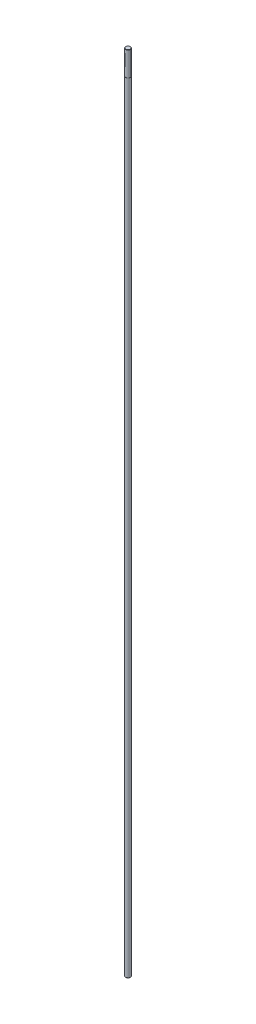
ISO-10303-21;
HEADER;
FILE_DESCRIPTION(('STEP AP214'),'2;1');
FILE_NAME('part.step','',(''),(''),'','','');
FILE_SCHEMA(('AUTOMOTIVE_DESIGN { 1 0 10303 214 1 1 1 1 }'));
ENDSEC;
DATA;
#1=APPLICATION_CONTEXT('core data for automotive mechanical design processes');
#2=APPLICATION_PROTOCOL_DEFINITION('international standard','automotive_design',2000,#1);
#3=PRODUCT_CONTEXT('',#1,'mechanical');
#4=PRODUCT('Part','Part','',(#3));
#5=PRODUCT_RELATED_PRODUCT_CATEGORY('part','',(#4));
#6=PRODUCT_DEFINITION_FORMATION('','',#4);
#7=PRODUCT_DEFINITION_CONTEXT('part definition',#1,'design');
#8=PRODUCT_DEFINITION('design','',#6,#7);
#9=PRODUCT_DEFINITION_SHAPE('','',#8);
#10=(LENGTH_UNIT() NAMED_UNIT(*) SI_UNIT(.MILLI.,.METRE.));
#11=(NAMED_UNIT(*) PLANE_ANGLE_UNIT() SI_UNIT($,.RADIAN.));
#12=(NAMED_UNIT(*) SI_UNIT($,.STERADIAN.) SOLID_ANGLE_UNIT());
#13=UNCERTAINTY_MEASURE_WITH_UNIT(LENGTH_MEASURE(1.E-05),#10,'distance_accuracy_value','');
#14=(GEOMETRIC_REPRESENTATION_CONTEXT(3) GLOBAL_UNCERTAINTY_ASSIGNED_CONTEXT((#13)) GLOBAL_UNIT_ASSIGNED_CONTEXT((#10,
#11,#12)) REPRESENTATION_CONTEXT('',''));
#15=CARTESIAN_POINT('',(0.,0.,0.));
#16=DIRECTION('',(0.,0.,1.));
#17=DIRECTION('',(1.,0.,0.));
#18=AXIS2_PLACEMENT_3D('',#15,#16,#17);
#19=CARTESIAN_POINT('',(0.,2662.36528765261,0.));
#20=DIRECTION('',(0.,1.,0.));
#21=DIRECTION('',(0.,0.,1.));
#22=AXIS2_PLACEMENT_3D('',#19,#20,#21);
#23=PLANE('',#22);
#24=CARTESIAN_POINT('',(0.,2662.36528765261,0.));
#25=DIRECTION('',(0.,1.,0.));
#26=DIRECTION('',(0.,0.,1.));
#27=AXIS2_PLACEMENT_3D('',#24,#25,#26);
#28=CIRCLE('',#27,16.);
#29=CARTESIAN_POINT('',(0.,2662.36528765261,16.));
#30=VERTEX_POINT('',#29);
#31=EDGE_CURVE('E57',#30,#30,#28,.T.);
#32=ORIENTED_EDGE('',*,*,#31,.T.);
#33=EDGE_LOOP('',(#32));
#34=FACE_BOUND('',#33,.T.);
#35=CARTESIAN_POINT('',(0.,2662.36528765261,0.));
#36=DIRECTION('',(0.,1.,0.));
#37=DIRECTION('',(0.,0.,1.));
#38=AXIS2_PLACEMENT_3D('',#35,#36,#37);
#39=CIRCLE('',#38,15.);
#40=CARTESIAN_POINT('',(0.,2662.36528765261,15.));
#41=VERTEX_POINT('',#40);
#42=EDGE_CURVE('E60',#41,#41,#39,.T.);
#43=ORIENTED_EDGE('',*,*,#42,.F.);
#44=EDGE_LOOP('',(#43));
#45=FACE_BOUND('',#44,.T.);
#46=ADVANCED_FACE('F37',(#34,#45),#23,.T.);
#47=CARTESIAN_POINT('',(0.,2662.36528765261,0.));
#48=DIRECTION('',(0.,-1.,0.));
#49=DIRECTION('',(0.,0.,-1.));
#50=AXIS2_PLACEMENT_3D('',#47,#48,#49);
#51=CYLINDRICAL_SURFACE('',#50,16.);
#52=CARTESIAN_POINT('',(0.,-2133.88471234739,0.));
#53=DIRECTION('',(0.,1.,0.));
#54=DIRECTION('',(0.,0.,1.));
#55=AXIS2_PLACEMENT_3D('',#52,#53,#54);
#56=CIRCLE('',#55,16.);
#57=CARTESIAN_POINT('',(0.,-2133.88471234739,16.));
#58=VERTEX_POINT('',#57);
#59=EDGE_CURVE('E44',#58,#58,#56,.T.);
#60=ORIENTED_EDGE('',*,*,#59,.T.);
#61=EDGE_LOOP('',(#60));
#62=FACE_BOUND('',#61,.T.);
#63=ORIENTED_EDGE('',*,*,#31,.F.);
#64=EDGE_LOOP('',(#63));
#65=FACE_BOUND('',#64,.T.);
#66=ADVANCED_FACE('F67',(#62,#65),#51,.T.);
#67=CARTESIAN_POINT('',(0.,-2137.63471234739,0.));
#68=DIRECTION('',(0.,1.,0.));
#69=DIRECTION('',(0.,0.,1.));
#70=AXIS2_PLACEMENT_3D('',#67,#68,#69);
#71=PLANE('',#70);
#72=CARTESIAN_POINT('',(0.,-2137.63471234739,0.));
#73=DIRECTION('',(0.,1.,0.));
#74=DIRECTION('',(0.,0.,1.));
#75=AXIS2_PLACEMENT_3D('',#72,#73,#74);
#76=CIRCLE('',#75,12.2499999999995);
#77=CARTESIAN_POINT('',(0.,-2137.63471234739,12.2499999999995));
#78=VERTEX_POINT('',#77);
#79=EDGE_CURVE('E10',#78,#78,#76,.F.);
#80=ORIENTED_EDGE('',*,*,#79,.T.);
#81=EDGE_LOOP('',(#80));
#82=FACE_BOUND('',#81,.T.);
#83=ADVANCED_FACE('F73',(#82),#71,.F.);
#84=CARTESIAN_POINT('',(0.,2812.36528765261,0.));
#85=DIRECTION('',(0.,-1.,0.));
#86=DIRECTION('',(0.,0.,-1.));
#87=AXIS2_PLACEMENT_3D('',#84,#85,#86);
#88=CYLINDRICAL_SURFACE('',#87,15.);
#89=CARTESIAN_POINT('',(0.,2810.86528765261,0.));
#90=DIRECTION('',(0.,1.,0.));
#91=DIRECTION('',(0.,0.,1.));
#92=AXIS2_PLACEMENT_3D('',#89,#90,#91);
#93=CIRCLE('',#92,15.);
#94=CARTESIAN_POINT('',(0.,2810.86528765261,15.));
#95=VERTEX_POINT('',#94);
#96=EDGE_CURVE('E48',#95,#95,#93,.F.);
#97=ORIENTED_EDGE('',*,*,#96,.T.);
#98=EDGE_LOOP('',(#97));
#99=FACE_BOUND('',#98,.T.);
#100=ORIENTED_EDGE('',*,*,#42,.T.);
#101=EDGE_LOOP('',(#100));
#102=FACE_BOUND('',#101,.T.);
#103=ADVANCED_FACE('F64',(#99,#102),#88,.T.);
#104=CARTESIAN_POINT('',(0.,2812.36528765261,0.));
#105=DIRECTION('',(0.,1.,0.));
#106=DIRECTION('',(0.,0.,1.));
#107=AXIS2_PLACEMENT_3D('',#104,#105,#106);
#108=PLANE('',#107);
#109=CARTESIAN_POINT('',(0.,2812.36528765261,0.));
#110=DIRECTION('',(0.,1.,0.));
#111=DIRECTION('',(0.,0.,1.));
#112=AXIS2_PLACEMENT_3D('',#109,#110,#111);
#113=CIRCLE('',#112,13.5000000000002);
#114=CARTESIAN_POINT('',(0.,2812.36528765261,13.5000000000002));
#115=VERTEX_POINT('',#114);
#116=EDGE_CURVE('E52',#115,#115,#113,.T.);
#117=ORIENTED_EDGE('',*,*,#116,.T.);
#118=EDGE_LOOP('',(#117));
#119=FACE_BOUND('',#118,.T.);
#120=ADVANCED_FACE('F81',(#119),#108,.T.);
#121=CARTESIAN_POINT('',(0.,2812.36528765261,0.));
#122=DIRECTION('',(0.,-1.,0.));
#123=DIRECTION('',(0.,0.,-1.));
#124=AXIS2_PLACEMENT_3D('',#121,#122,#123);
#125=CONICAL_SURFACE('',#124,13.5000000000002,0.785398163397444);
#126=ORIENTED_EDGE('',*,*,#96,.F.);
#127=EDGE_LOOP('',(#126));
#128=FACE_BOUND('',#127,.T.);
#129=ORIENTED_EDGE('',*,*,#116,.F.);
#130=EDGE_LOOP('',(#129));
#131=FACE_BOUND('',#130,.T.);
#132=ADVANCED_FACE('F79',(#128,#131),#125,.T.);
#133=CARTESIAN_POINT('',(0.,-2133.88471234739,0.));
#134=DIRECTION('',(0.,1.,0.));
#135=DIRECTION('',(0.,0.,1.));
#136=AXIS2_PLACEMENT_3D('',#133,#134,#135);
#137=CONICAL_SURFACE('',#136,16.,0.785398163397461);
#138=ORIENTED_EDGE('',*,*,#79,.F.);
#139=EDGE_LOOP('',(#138));
#140=FACE_BOUND('',#139,.T.);
#141=ORIENTED_EDGE('',*,*,#59,.F.);
#142=EDGE_LOOP('',(#141));
#143=FACE_BOUND('',#142,.T.);
#144=ADVANCED_FACE('F39',(#140,#143),#137,.T.);
#145=CLOSED_SHELL('',(#46,#66,#83,#103,#120,#132,#144));
#146=MANIFOLD_SOLID_BREP('B2',#145);
#147=ADVANCED_BREP_SHAPE_REPRESENTATION('',(#18,#146),#14);
#148=SHAPE_DEFINITION_REPRESENTATION(#9,#147);
ENDSEC;
END-ISO-10303-21;
